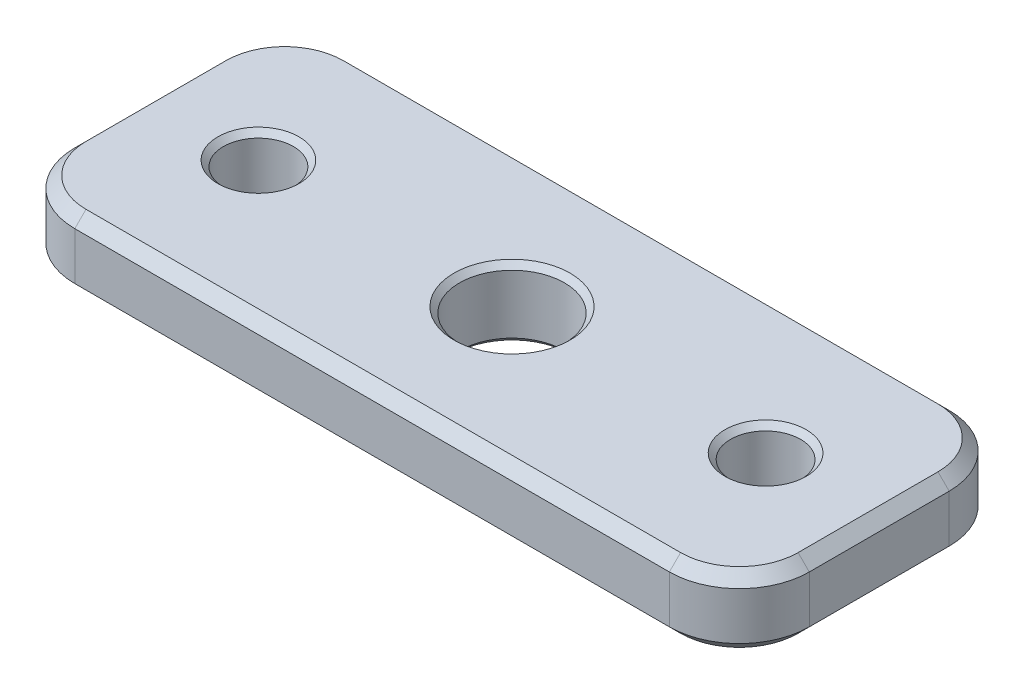
ISO-10303-21;
HEADER;
FILE_DESCRIPTION(('STEP AP214'),'2;1');
FILE_NAME('part.step','',(''),(''),'','','');
FILE_SCHEMA(('AUTOMOTIVE_DESIGN { 1 0 10303 214 1 1 1 1 }'));
ENDSEC;
DATA;
#1=APPLICATION_CONTEXT('core data for automotive mechanical design processes');
#2=APPLICATION_PROTOCOL_DEFINITION('international standard','automotive_design',2000,#1);
#3=PRODUCT_CONTEXT('',#1,'mechanical');
#4=PRODUCT('Part','Part','',(#3));
#5=PRODUCT_RELATED_PRODUCT_CATEGORY('part','',(#4));
#6=PRODUCT_DEFINITION_FORMATION('','',#4);
#7=PRODUCT_DEFINITION_CONTEXT('part definition',#1,'design');
#8=PRODUCT_DEFINITION('design','',#6,#7);
#9=PRODUCT_DEFINITION_SHAPE('','',#8);
#10=(LENGTH_UNIT() NAMED_UNIT(*) SI_UNIT(.MILLI.,.METRE.));
#11=(NAMED_UNIT(*) PLANE_ANGLE_UNIT() SI_UNIT($,.RADIAN.));
#12=(NAMED_UNIT(*) SI_UNIT($,.STERADIAN.) SOLID_ANGLE_UNIT());
#13=UNCERTAINTY_MEASURE_WITH_UNIT(LENGTH_MEASURE(1.E-05),#10,'distance_accuracy_value','');
#14=(GEOMETRIC_REPRESENTATION_CONTEXT(3) GLOBAL_UNCERTAINTY_ASSIGNED_CONTEXT((#13)) GLOBAL_UNIT_ASSIGNED_CONTEXT((#10,
#11,#12)) REPRESENTATION_CONTEXT('',''));
#15=CARTESIAN_POINT('',(0.,0.,0.));
#16=DIRECTION('',(0.,0.,1.));
#17=DIRECTION('',(1.,0.,0.));
#18=AXIS2_PLACEMENT_3D('',#15,#16,#17);
#19=CARTESIAN_POINT('',(0.,3.175,0.));
#20=DIRECTION('',(0.,-1.,0.));
#21=DIRECTION('',(0.,0.,-1.));
#22=AXIS2_PLACEMENT_3D('',#19,#20,#21);
#23=PLANE('',#22);
#24=CARTESIAN_POINT('',(11.509375,3.175,0.));
#25=DIRECTION('',(0.,-1.,0.));
#26=DIRECTION('',(0.,0.,-1.));
#27=AXIS2_PLACEMENT_3D('',#24,#25,#26);
#28=CIRCLE('',#27,1.8415);
#29=CARTESIAN_POINT('',(11.509375,3.175,-1.8415));
#30=VERTEX_POINT('',#29);
#31=EDGE_CURVE('E225',#30,#30,#28,.T.);
#32=ORIENTED_EDGE('',*,*,#31,.T.);
#33=EDGE_LOOP('',(#32));
#34=FACE_BOUND('',#33,.T.);
#35=CARTESIAN_POINT('',(0.,3.175,0.));
#36=DIRECTION('',(0.,-1.,0.));
#37=DIRECTION('',(0.,0.,-1.));
#38=AXIS2_PLACEMENT_3D('',#35,#36,#37);
#39=CIRCLE('',#38,2.63525000000002);
#40=CARTESIAN_POINT('',(0.,3.175,-2.63525000000002));
#41=VERTEX_POINT('',#40);
#42=EDGE_CURVE('E222',#41,#41,#39,.T.);
#43=ORIENTED_EDGE('',*,*,#42,.T.);
#44=EDGE_LOOP('',(#43));
#45=FACE_BOUND('',#44,.T.);
#46=CARTESIAN_POINT('',(-11.509375,3.175,0.));
#47=DIRECTION('',(0.,-1.,0.));
#48=DIRECTION('',(0.,0.,-1.));
#49=AXIS2_PLACEMENT_3D('',#46,#47,#48);
#50=CIRCLE('',#49,1.8415);
#51=CARTESIAN_POINT('',(-11.509375,3.175,-1.8415));
#52=VERTEX_POINT('',#51);
#53=EDGE_CURVE('E219',#52,#52,#50,.T.);
#54=ORIENTED_EDGE('',*,*,#53,.T.);
#55=EDGE_LOOP('',(#54));
#56=FACE_BOUND('',#55,.T.);
#57=CARTESIAN_POINT('',(13.49375,3.175,-3.175));
#58=DIRECTION('',(0.,-1.,0.));
#59=DIRECTION('',(0.,0.,-1.));
#60=AXIS2_PLACEMENT_3D('',#57,#58,#59);
#61=CIRCLE('',#60,2.66699999999999);
#62=CARTESIAN_POINT('',(16.16075,3.175,-3.175));
#63=VERTEX_POINT('',#62);
#64=CARTESIAN_POINT('',(13.49375,3.175,-5.842));
#65=VERTEX_POINT('',#64);
#66=EDGE_CURVE('E695',#63,#65,#61,.F.);
#67=ORIENTED_EDGE('',*,*,#66,.T.);
#68=DIRECTION('',(-1.,0.,0.));
#69=VECTOR('',#68,1.);
#70=CARTESIAN_POINT('',(0.,3.175,-5.842));
#71=LINE('',#70,#69);
#72=CARTESIAN_POINT('',(-13.49375,3.175,-5.842));
#73=VERTEX_POINT('',#72);
#74=EDGE_CURVE('E699',#65,#73,#71,.T.);
#75=ORIENTED_EDGE('',*,*,#74,.T.);
#76=CARTESIAN_POINT('',(-13.49375,3.175,-3.175));
#77=DIRECTION('',(0.,-1.,0.));
#78=DIRECTION('',(0.,0.,-1.));
#79=AXIS2_PLACEMENT_3D('',#76,#77,#78);
#80=CIRCLE('',#79,2.667);
#81=CARTESIAN_POINT('',(-16.16075,3.175,-3.175));
#82=VERTEX_POINT('',#81);
#83=EDGE_CURVE('E697',#73,#82,#80,.F.);
#84=ORIENTED_EDGE('',*,*,#83,.T.);
#85=DIRECTION('',(0.,0.,1.));
#86=VECTOR('',#85,1.);
#87=CARTESIAN_POINT('',(-16.16075,3.175,0.));
#88=LINE('',#87,#86);
#89=CARTESIAN_POINT('',(-16.16075,3.175,3.175));
#90=VERTEX_POINT('',#89);
#91=EDGE_CURVE('E151',#82,#90,#88,.T.);
#92=ORIENTED_EDGE('',*,*,#91,.T.);
#93=CARTESIAN_POINT('',(-13.49375,3.175,3.175));
#94=DIRECTION('',(0.,-1.,0.));
#95=DIRECTION('',(0.,0.,-1.));
#96=AXIS2_PLACEMENT_3D('',#93,#94,#95);
#97=CIRCLE('',#96,2.66699999999999);
#98=CARTESIAN_POINT('',(-13.49375,3.175,5.842));
#99=VERTEX_POINT('',#98);
#100=EDGE_CURVE('E146',#90,#99,#97,.F.);
#101=ORIENTED_EDGE('',*,*,#100,.T.);
#102=DIRECTION('',(1.,0.,0.));
#103=VECTOR('',#102,1.);
#104=CARTESIAN_POINT('',(0.,3.175,5.842));
#105=LINE('',#104,#103);
#106=CARTESIAN_POINT('',(13.49375,3.175,5.842));
#107=VERTEX_POINT('',#106);
#108=EDGE_CURVE('E148',#99,#107,#105,.T.);
#109=ORIENTED_EDGE('',*,*,#108,.T.);
#110=CARTESIAN_POINT('',(13.49375,3.175,3.175));
#111=DIRECTION('',(0.,-1.,0.));
#112=DIRECTION('',(0.,0.,-1.));
#113=AXIS2_PLACEMENT_3D('',#110,#111,#112);
#114=CIRCLE('',#113,2.667);
#115=CARTESIAN_POINT('',(16.16075,3.175,3.175));
#116=VERTEX_POINT('',#115);
#117=EDGE_CURVE('E157',#107,#116,#114,.F.);
#118=ORIENTED_EDGE('',*,*,#117,.T.);
#119=DIRECTION('',(0.,0.,-1.));
#120=VECTOR('',#119,1.);
#121=CARTESIAN_POINT('',(16.16075,3.175,0.));
#122=LINE('',#121,#120);
#123=EDGE_CURVE('E156',#116,#63,#122,.T.);
#124=ORIENTED_EDGE('',*,*,#123,.T.);
#125=EDGE_LOOP('',(#67,#75,#84,#92,#101,#109,#118,#124));
#126=FACE_BOUND('',#125,.T.);
#127=ADVANCED_FACE('F32',(#34,#45,#56,#126),#23,.F.);
#128=CARTESIAN_POINT('',(0.,0.,0.));
#129=DIRECTION('',(0.,-1.,0.));
#130=DIRECTION('',(0.,0.,-1.));
#131=AXIS2_PLACEMENT_3D('',#128,#129,#130);
#132=PLANE('',#131);
#133=CARTESIAN_POINT('',(11.509375,0.,0.));
#134=DIRECTION('',(0.,-1.,0.));
#135=DIRECTION('',(0.,0.,-1.));
#136=AXIS2_PLACEMENT_3D('',#133,#134,#135);
#137=CIRCLE('',#136,1.84150000000001);
#138=CARTESIAN_POINT('',(11.509375,0.,-1.84150000000001));
#139=VERTEX_POINT('',#138);
#140=EDGE_CURVE('E210',#139,#139,#137,.F.);
#141=ORIENTED_EDGE('',*,*,#140,.T.);
#142=EDGE_LOOP('',(#141));
#143=FACE_BOUND('',#142,.T.);
#144=CARTESIAN_POINT('',(0.,0.,0.));
#145=DIRECTION('',(0.,-1.,0.));
#146=DIRECTION('',(0.,0.,-1.));
#147=AXIS2_PLACEMENT_3D('',#144,#145,#146);
#148=CIRCLE('',#147,2.63525000000001);
#149=CARTESIAN_POINT('',(0.,0.,-2.63525000000001));
#150=VERTEX_POINT('',#149);
#151=EDGE_CURVE('E206',#150,#150,#148,.F.);
#152=ORIENTED_EDGE('',*,*,#151,.T.);
#153=EDGE_LOOP('',(#152));
#154=FACE_BOUND('',#153,.T.);
#155=CARTESIAN_POINT('',(-11.509375,0.,0.));
#156=DIRECTION('',(0.,-1.,0.));
#157=DIRECTION('',(0.,0.,-1.));
#158=AXIS2_PLACEMENT_3D('',#155,#156,#157);
#159=CIRCLE('',#158,1.8415);
#160=CARTESIAN_POINT('',(-11.509375,0.,-1.8415));
#161=VERTEX_POINT('',#160);
#162=EDGE_CURVE('E203',#161,#161,#159,.F.);
#163=ORIENTED_EDGE('',*,*,#162,.T.);
#164=EDGE_LOOP('',(#163));
#165=FACE_BOUND('',#164,.T.);
#166=CARTESIAN_POINT('',(-13.49375,0.,-3.175));
#167=DIRECTION('',(0.,-1.,0.));
#168=DIRECTION('',(0.,0.,-1.));
#169=AXIS2_PLACEMENT_3D('',#166,#167,#168);
#170=CIRCLE('',#169,2.66700000000001);
#171=CARTESIAN_POINT('',(-16.16075,0.,-3.175));
#172=VERTEX_POINT('',#171);
#173=CARTESIAN_POINT('',(-13.49375,0.,-5.842));
#174=VERTEX_POINT('',#173);
#175=EDGE_CURVE('E47',#172,#174,#170,.T.);
#176=ORIENTED_EDGE('',*,*,#175,.T.);
#177=DIRECTION('',(1.,0.,0.));
#178=VECTOR('',#177,1.);
#179=CARTESIAN_POINT('',(13.49375,0.,-5.842));
#180=LINE('',#179,#178);
#181=CARTESIAN_POINT('',(13.49375,0.,-5.84200000000001));
#182=VERTEX_POINT('',#181);
#183=EDGE_CURVE('E207',#174,#182,#180,.T.);
#184=ORIENTED_EDGE('',*,*,#183,.T.);
#185=CARTESIAN_POINT('',(13.49375,0.,-3.175));
#186=DIRECTION('',(0.,-1.,0.));
#187=DIRECTION('',(0.,0.,-1.));
#188=AXIS2_PLACEMENT_3D('',#185,#186,#187);
#189=CIRCLE('',#188,2.66700000000001);
#190=CARTESIAN_POINT('',(16.16075,0.,-3.175));
#191=VERTEX_POINT('',#190);
#192=EDGE_CURVE('E620',#182,#191,#189,.T.);
#193=ORIENTED_EDGE('',*,*,#192,.T.);
#194=DIRECTION('',(0.,0.,1.));
#195=VECTOR('',#194,1.);
#196=CARTESIAN_POINT('',(16.16075,0.,3.175));
#197=LINE('',#196,#195);
#198=CARTESIAN_POINT('',(16.16075,0.,3.175));
#199=VERTEX_POINT('',#198);
#200=EDGE_CURVE('E611',#191,#199,#197,.T.);
#201=ORIENTED_EDGE('',*,*,#200,.T.);
#202=CARTESIAN_POINT('',(13.49375,0.,3.175));
#203=DIRECTION('',(0.,-1.,0.));
#204=DIRECTION('',(0.,0.,-1.));
#205=AXIS2_PLACEMENT_3D('',#202,#203,#204);
#206=CIRCLE('',#205,2.66700000000001);
#207=CARTESIAN_POINT('',(13.49375,0.,5.842));
#208=VERTEX_POINT('',#207);
#209=EDGE_CURVE('E612',#199,#208,#206,.T.);
#210=ORIENTED_EDGE('',*,*,#209,.T.);
#211=DIRECTION('',(-1.,0.,0.));
#212=VECTOR('',#211,1.);
#213=CARTESIAN_POINT('',(-13.49375,0.,5.842));
#214=LINE('',#213,#212);
#215=CARTESIAN_POINT('',(-13.49375,0.,5.842));
#216=VERTEX_POINT('',#215);
#217=EDGE_CURVE('E605',#208,#216,#214,.T.);
#218=ORIENTED_EDGE('',*,*,#217,.T.);
#219=CARTESIAN_POINT('',(-13.49375,0.,3.175));
#220=DIRECTION('',(0.,-1.,0.));
#221=DIRECTION('',(0.,0.,-1.));
#222=AXIS2_PLACEMENT_3D('',#219,#220,#221);
#223=CIRCLE('',#222,2.66700000000001);
#224=CARTESIAN_POINT('',(-16.16075,0.,3.175));
#225=VERTEX_POINT('',#224);
#226=EDGE_CURVE('E609',#216,#225,#223,.T.);
#227=ORIENTED_EDGE('',*,*,#226,.T.);
#228=DIRECTION('',(0.,0.,-1.));
#229=VECTOR('',#228,1.);
#230=CARTESIAN_POINT('',(-16.16075,0.,-3.175));
#231=LINE('',#230,#229);
#232=EDGE_CURVE('E614',#225,#172,#231,.T.);
#233=ORIENTED_EDGE('',*,*,#232,.T.);
#234=EDGE_LOOP('',(#176,#184,#193,#201,#210,#218,#227,#233));
#235=FACE_BOUND('',#234,.T.);
#236=ADVANCED_FACE('F248',(#143,#154,#165,#235),#132,.T.);
#237=CARTESIAN_POINT('',(16.66875,3.175,6.35));
#238=DIRECTION('',(-1.,0.,0.));
#239=DIRECTION('',(0.,0.,1.));
#240=AXIS2_PLACEMENT_3D('',#237,#238,#239);
#241=PLANE('',#240);
#242=DIRECTION('',(0.,-1.,0.));
#243=VECTOR('',#242,1.);
#244=CARTESIAN_POINT('',(16.66875,3.175,-3.175));
#245=LINE('',#244,#243);
#246=CARTESIAN_POINT('',(16.66875,0.507999999999995,-3.175));
#247=VERTEX_POINT('',#246);
#248=CARTESIAN_POINT('',(16.66875,2.66699999999999,-3.175));
#249=VERTEX_POINT('',#248);
#250=EDGE_CURVE('E174',#247,#249,#245,.F.);
#251=ORIENTED_EDGE('',*,*,#250,.T.);
#252=DIRECTION('',(0.,0.,1.));
#253=VECTOR('',#252,1.);
#254=CARTESIAN_POINT('',(16.66875,2.66699999999999,6.35));
#255=LINE('',#254,#253);
#256=CARTESIAN_POINT('',(16.66875,2.66699999999999,3.175));
#257=VERTEX_POINT('',#256);
#258=EDGE_CURVE('E642',#249,#257,#255,.T.);
#259=ORIENTED_EDGE('',*,*,#258,.T.);
#260=DIRECTION('',(0.,-1.,0.));
#261=VECTOR('',#260,1.);
#262=CARTESIAN_POINT('',(16.66875,3.175,3.175));
#263=LINE('',#262,#261);
#264=CARTESIAN_POINT('',(16.66875,0.507999999999995,3.175));
#265=VERTEX_POINT('',#264);
#266=EDGE_CURVE('E670',#257,#265,#263,.T.);
#267=ORIENTED_EDGE('',*,*,#266,.T.);
#268=DIRECTION('',(0.,0.,-1.));
#269=VECTOR('',#268,1.);
#270=CARTESIAN_POINT('',(16.66875,0.507999999999995,-3.175));
#271=LINE('',#270,#269);
#272=EDGE_CURVE('E639',#265,#247,#271,.T.);
#273=ORIENTED_EDGE('',*,*,#272,.T.);
#274=EDGE_LOOP('',(#251,#259,#267,#273));
#275=FACE_BOUND('',#274,.T.);
#276=ADVANCED_FACE('F254',(#275),#241,.F.);
#277=CARTESIAN_POINT('',(-16.66875,3.175,-6.35));
#278=DIRECTION('',(0.,0.,1.));
#279=DIRECTION('',(1.,0.,0.));
#280=AXIS2_PLACEMENT_3D('',#277,#278,#279);
#281=PLANE('',#280);
#282=DIRECTION('',(0.,-1.,0.));
#283=VECTOR('',#282,1.);
#284=CARTESIAN_POINT('',(-13.49375,3.175,-6.35));
#285=LINE('',#284,#283);
#286=CARTESIAN_POINT('',(-13.49375,0.507999999999995,-6.35));
#287=VERTEX_POINT('',#286);
#288=CARTESIAN_POINT('',(-13.49375,2.66699999999999,-6.35));
#289=VERTEX_POINT('',#288);
#290=EDGE_CURVE('E168',#287,#289,#285,.F.);
#291=ORIENTED_EDGE('',*,*,#290,.T.);
#292=DIRECTION('',(1.,0.,0.));
#293=VECTOR('',#292,1.);
#294=CARTESIAN_POINT('',(-16.66875,2.66699999999999,-6.35));
#295=LINE('',#294,#293);
#296=CARTESIAN_POINT('',(13.49375,2.66699999999999,-6.35));
#297=VERTEX_POINT('',#296);
#298=EDGE_CURVE('E705',#289,#297,#295,.T.);
#299=ORIENTED_EDGE('',*,*,#298,.T.);
#300=DIRECTION('',(0.,-1.,0.));
#301=VECTOR('',#300,1.);
#302=CARTESIAN_POINT('',(13.49375,3.175,-6.35));
#303=LINE('',#302,#301);
#304=CARTESIAN_POINT('',(13.49375,0.507999999999995,-6.35));
#305=VERTEX_POINT('',#304);
#306=EDGE_CURVE('E688',#297,#305,#303,.T.);
#307=ORIENTED_EDGE('',*,*,#306,.T.);
#308=DIRECTION('',(-1.,0.,0.));
#309=VECTOR('',#308,1.);
#310=CARTESIAN_POINT('',(-13.49375,0.507999999999995,-6.35));
#311=LINE('',#310,#309);
#312=EDGE_CURVE('E702',#305,#287,#311,.T.);
#313=ORIENTED_EDGE('',*,*,#312,.T.);
#314=EDGE_LOOP('',(#291,#299,#307,#313));
#315=FACE_BOUND('',#314,.T.);
#316=ADVANCED_FACE('F268',(#315),#281,.F.);
#317=CARTESIAN_POINT('',(-16.66875,3.175,6.35));
#318=DIRECTION('',(1.,0.,0.));
#319=DIRECTION('',(0.,0.,-1.));
#320=AXIS2_PLACEMENT_3D('',#317,#318,#319);
#321=PLANE('',#320);
#322=DIRECTION('',(0.,-1.,0.));
#323=VECTOR('',#322,1.);
#324=CARTESIAN_POINT('',(-16.66875,3.175,3.175));
#325=LINE('',#324,#323);
#326=CARTESIAN_POINT('',(-16.66875,0.507999999999995,3.175));
#327=VERTEX_POINT('',#326);
#328=CARTESIAN_POINT('',(-16.66875,2.66699999999999,3.175));
#329=VERTEX_POINT('',#328);
#330=EDGE_CURVE('E684',#327,#329,#325,.F.);
#331=ORIENTED_EDGE('',*,*,#330,.T.);
#332=DIRECTION('',(0.,0.,-1.));
#333=VECTOR('',#332,1.);
#334=CARTESIAN_POINT('',(-16.66875,2.66699999999999,6.35));
#335=LINE('',#334,#333);
#336=CARTESIAN_POINT('',(-16.66875,2.66699999999999,-3.175));
#337=VERTEX_POINT('',#336);
#338=EDGE_CURVE('E634',#329,#337,#335,.T.);
#339=ORIENTED_EDGE('',*,*,#338,.T.);
#340=DIRECTION('',(0.,-1.,0.));
#341=VECTOR('',#340,1.);
#342=CARTESIAN_POINT('',(-16.66875,3.175,-3.175));
#343=LINE('',#342,#341);
#344=CARTESIAN_POINT('',(-16.66875,0.507999999999995,-3.175));
#345=VERTEX_POINT('',#344);
#346=EDGE_CURVE('E686',#337,#345,#343,.T.);
#347=ORIENTED_EDGE('',*,*,#346,.T.);
#348=DIRECTION('',(0.,0.,1.));
#349=VECTOR('',#348,1.);
#350=CARTESIAN_POINT('',(-16.66875,0.507999999999995,3.175));
#351=LINE('',#350,#349);
#352=EDGE_CURVE('E640',#345,#327,#351,.T.);
#353=ORIENTED_EDGE('',*,*,#352,.T.);
#354=EDGE_LOOP('',(#331,#339,#347,#353));
#355=FACE_BOUND('',#354,.T.);
#356=ADVANCED_FACE('F264',(#355),#321,.F.);
#357=CARTESIAN_POINT('',(-16.66875,3.175,6.35));
#358=DIRECTION('',(0.,0.,-1.));
#359=DIRECTION('',(-1.,0.,0.));
#360=AXIS2_PLACEMENT_3D('',#357,#358,#359);
#361=PLANE('',#360);
#362=DIRECTION('',(0.,-1.,0.));
#363=VECTOR('',#362,1.);
#364=CARTESIAN_POINT('',(13.49375,3.175,6.35));
#365=LINE('',#364,#363);
#366=CARTESIAN_POINT('',(13.49375,0.507999999999995,6.35));
#367=VERTEX_POINT('',#366);
#368=CARTESIAN_POINT('',(13.49375,2.66699999999999,6.35));
#369=VERTEX_POINT('',#368);
#370=EDGE_CURVE('E681',#367,#369,#365,.F.);
#371=ORIENTED_EDGE('',*,*,#370,.T.);
#372=DIRECTION('',(-1.,0.,0.));
#373=VECTOR('',#372,1.);
#374=CARTESIAN_POINT('',(-16.66875,2.66699999999999,6.35));
#375=LINE('',#374,#373);
#376=CARTESIAN_POINT('',(-13.49375,2.66699999999999,6.35));
#377=VERTEX_POINT('',#376);
#378=EDGE_CURVE('E657',#369,#377,#375,.T.);
#379=ORIENTED_EDGE('',*,*,#378,.T.);
#380=DIRECTION('',(0.,-1.,0.));
#381=VECTOR('',#380,1.);
#382=CARTESIAN_POINT('',(-13.49375,3.175,6.35));
#383=LINE('',#382,#381);
#384=CARTESIAN_POINT('',(-13.49375,0.507999999999995,6.35));
#385=VERTEX_POINT('',#384);
#386=EDGE_CURVE('E676',#377,#385,#383,.T.);
#387=ORIENTED_EDGE('',*,*,#386,.T.);
#388=DIRECTION('',(1.,0.,0.));
#389=VECTOR('',#388,1.);
#390=CARTESIAN_POINT('',(13.49375,0.507999999999995,6.35));
#391=LINE('',#390,#389);
#392=EDGE_CURVE('E606',#385,#367,#391,.T.);
#393=ORIENTED_EDGE('',*,*,#392,.T.);
#394=EDGE_LOOP('',(#371,#379,#387,#393));
#395=FACE_BOUND('',#394,.T.);
#396=ADVANCED_FACE('F261',(#395),#361,.F.);
#397=CARTESIAN_POINT('',(-11.509375,3.175,0.));
#398=DIRECTION('',(0.,-1.,0.));
#399=DIRECTION('',(0.,0.,-1.));
#400=AXIS2_PLACEMENT_3D('',#397,#398,#399);
#401=CYLINDRICAL_SURFACE('',#400,1.5875);
#402=CARTESIAN_POINT('',(-11.509375,0.254,0.));
#403=DIRECTION('',(0.,-1.,0.));
#404=DIRECTION('',(0.,0.,-1.));
#405=AXIS2_PLACEMENT_3D('',#402,#403,#404);
#406=CIRCLE('',#405,1.5875);
#407=CARTESIAN_POINT('',(-11.509375,0.254,-1.5875));
#408=VERTEX_POINT('',#407);
#409=EDGE_CURVE('E11',#408,#408,#406,.T.);
#410=ORIENTED_EDGE('',*,*,#409,.T.);
#411=EDGE_LOOP('',(#410));
#412=FACE_BOUND('',#411,.T.);
#413=CARTESIAN_POINT('',(-11.509375,2.921,0.));
#414=DIRECTION('',(0.,-1.,0.));
#415=DIRECTION('',(0.,0.,-1.));
#416=AXIS2_PLACEMENT_3D('',#413,#414,#415);
#417=CIRCLE('',#416,1.5875);
#418=CARTESIAN_POINT('',(-11.509375,2.921,-1.5875));
#419=VERTEX_POINT('',#418);
#420=EDGE_CURVE('E40',#419,#419,#417,.F.);
#421=ORIENTED_EDGE('',*,*,#420,.T.);
#422=EDGE_LOOP('',(#421));
#423=FACE_BOUND('',#422,.T.);
#424=ADVANCED_FACE('F236',(#412,#423),#401,.F.);
#425=CARTESIAN_POINT('',(11.509375,3.175,0.));
#426=DIRECTION('',(0.,-1.,0.));
#427=DIRECTION('',(0.,0.,-1.));
#428=AXIS2_PLACEMENT_3D('',#425,#426,#427);
#429=CYLINDRICAL_SURFACE('',#428,1.5875);
#430=CARTESIAN_POINT('',(11.509375,0.254000000000011,0.));
#431=DIRECTION('',(0.,-1.,0.));
#432=DIRECTION('',(0.,0.,-1.));
#433=AXIS2_PLACEMENT_3D('',#430,#431,#432);
#434=CIRCLE('',#433,1.5875);
#435=CARTESIAN_POINT('',(11.509375,0.254000000000011,-1.5875));
#436=VERTEX_POINT('',#435);
#437=EDGE_CURVE('E216',#436,#436,#434,.T.);
#438=ORIENTED_EDGE('',*,*,#437,.T.);
#439=EDGE_LOOP('',(#438));
#440=FACE_BOUND('',#439,.T.);
#441=CARTESIAN_POINT('',(11.509375,2.921,0.));
#442=DIRECTION('',(0.,-1.,0.));
#443=DIRECTION('',(0.,0.,-1.));
#444=AXIS2_PLACEMENT_3D('',#441,#442,#443);
#445=CIRCLE('',#444,1.5875);
#446=CARTESIAN_POINT('',(11.509375,2.921,-1.5875));
#447=VERTEX_POINT('',#446);
#448=EDGE_CURVE('E213',#447,#447,#445,.F.);
#449=ORIENTED_EDGE('',*,*,#448,.T.);
#450=EDGE_LOOP('',(#449));
#451=FACE_BOUND('',#450,.T.);
#452=ADVANCED_FACE('F373',(#440,#451),#429,.F.);
#453=CARTESIAN_POINT('',(0.,3.175,0.));
#454=DIRECTION('',(0.,-1.,0.));
#455=DIRECTION('',(0.,0.,-1.));
#456=AXIS2_PLACEMENT_3D('',#453,#454,#455);
#457=CYLINDRICAL_SURFACE('',#456,2.38125);
#458=CARTESIAN_POINT('',(0.,0.254000000000011,0.));
#459=DIRECTION('',(0.,-1.,0.));
#460=DIRECTION('',(0.,0.,-1.));
#461=AXIS2_PLACEMENT_3D('',#458,#459,#460);
#462=CIRCLE('',#461,2.38125);
#463=CARTESIAN_POINT('',(0.,0.254000000000011,-2.38125));
#464=VERTEX_POINT('',#463);
#465=EDGE_CURVE('E231',#464,#464,#462,.T.);
#466=ORIENTED_EDGE('',*,*,#465,.T.);
#467=EDGE_LOOP('',(#466));
#468=FACE_BOUND('',#467,.T.);
#469=CARTESIAN_POINT('',(0.,2.92099999999999,0.));
#470=DIRECTION('',(0.,-1.,0.));
#471=DIRECTION('',(0.,0.,-1.));
#472=AXIS2_PLACEMENT_3D('',#469,#470,#471);
#473=CIRCLE('',#472,2.38125);
#474=CARTESIAN_POINT('',(0.,2.92099999999999,-2.38125));
#475=VERTEX_POINT('',#474);
#476=EDGE_CURVE('E228',#475,#475,#473,.F.);
#477=ORIENTED_EDGE('',*,*,#476,.T.);
#478=EDGE_LOOP('',(#477));
#479=FACE_BOUND('',#478,.T.);
#480=ADVANCED_FACE('F280',(#468,#479),#457,.F.);
#481=CARTESIAN_POINT('',(13.49375,3.175,3.175));
#482=DIRECTION('',(0.,-1.,0.));
#483=DIRECTION('',(0.,0.,-1.));
#484=AXIS2_PLACEMENT_3D('',#481,#482,#483);
#485=CYLINDRICAL_SURFACE('',#484,3.175);
#486=ORIENTED_EDGE('',*,*,#266,.F.);
#487=CARTESIAN_POINT('',(13.49375,2.66699999999999,3.175));
#488=DIRECTION('',(0.,-1.,0.));
#489=DIRECTION('',(0.,0.,-1.));
#490=AXIS2_PLACEMENT_3D('',#487,#488,#489);
#491=CIRCLE('',#490,3.175);
#492=EDGE_CURVE('E654',#257,#369,#491,.T.);
#493=ORIENTED_EDGE('',*,*,#492,.T.);
#494=ORIENTED_EDGE('',*,*,#370,.F.);
#495=CARTESIAN_POINT('',(13.49375,0.507999999999995,3.175));
#496=DIRECTION('',(0.,-1.,0.));
#497=DIRECTION('',(0.,0.,-1.));
#498=AXIS2_PLACEMENT_3D('',#495,#496,#497);
#499=CIRCLE('',#498,3.175);
#500=EDGE_CURVE('E652',#367,#265,#499,.F.);
#501=ORIENTED_EDGE('',*,*,#500,.T.);
#502=EDGE_LOOP('',(#486,#493,#494,#501));
#503=FACE_BOUND('',#502,.T.);
#504=ADVANCED_FACE('F276',(#503),#485,.T.);
#505=CARTESIAN_POINT('',(-13.49375,3.175,-3.175));
#506=DIRECTION('',(0.,-1.,0.));
#507=DIRECTION('',(0.,0.,-1.));
#508=AXIS2_PLACEMENT_3D('',#505,#506,#507);
#509=CYLINDRICAL_SURFACE('',#508,3.175);
#510=ORIENTED_EDGE('',*,*,#346,.F.);
#511=CARTESIAN_POINT('',(-13.49375,2.66699999999999,-3.175));
#512=DIRECTION('',(0.,-1.,0.));
#513=DIRECTION('',(0.,0.,-1.));
#514=AXIS2_PLACEMENT_3D('',#511,#512,#513);
#515=CIRCLE('',#514,3.175);
#516=EDGE_CURVE('E710',#337,#289,#515,.T.);
#517=ORIENTED_EDGE('',*,*,#516,.T.);
#518=ORIENTED_EDGE('',*,*,#290,.F.);
#519=CARTESIAN_POINT('',(-13.49375,0.507999999999995,-3.175));
#520=DIRECTION('',(0.,-1.,0.));
#521=DIRECTION('',(0.,0.,-1.));
#522=AXIS2_PLACEMENT_3D('',#519,#520,#521);
#523=CIRCLE('',#522,3.175);
#524=EDGE_CURVE('E708',#287,#345,#523,.F.);
#525=ORIENTED_EDGE('',*,*,#524,.T.);
#526=EDGE_LOOP('',(#510,#517,#518,#525));
#527=FACE_BOUND('',#526,.T.);
#528=ADVANCED_FACE('F279',(#527),#509,.T.);
#529=CARTESIAN_POINT('',(13.49375,3.175,-3.175));
#530=DIRECTION('',(0.,-1.,0.));
#531=DIRECTION('',(0.,0.,-1.));
#532=AXIS2_PLACEMENT_3D('',#529,#530,#531);
#533=CYLINDRICAL_SURFACE('',#532,3.175);
#534=ORIENTED_EDGE('',*,*,#306,.F.);
#535=CARTESIAN_POINT('',(13.49375,2.66699999999999,-3.175));
#536=DIRECTION('',(0.,-1.,0.));
#537=DIRECTION('',(0.,0.,-1.));
#538=AXIS2_PLACEMENT_3D('',#535,#536,#537);
#539=CIRCLE('',#538,3.175);
#540=EDGE_CURVE('E644',#297,#249,#539,.T.);
#541=ORIENTED_EDGE('',*,*,#540,.T.);
#542=ORIENTED_EDGE('',*,*,#250,.F.);
#543=CARTESIAN_POINT('',(13.49375,0.507999999999995,-3.175));
#544=DIRECTION('',(0.,-1.,0.));
#545=DIRECTION('',(0.,0.,-1.));
#546=AXIS2_PLACEMENT_3D('',#543,#544,#545);
#547=CIRCLE('',#546,3.175);
#548=EDGE_CURVE('E672',#247,#305,#547,.F.);
#549=ORIENTED_EDGE('',*,*,#548,.T.);
#550=EDGE_LOOP('',(#534,#541,#542,#549));
#551=FACE_BOUND('',#550,.T.);
#552=ADVANCED_FACE('F284',(#551),#533,.T.);
#553=CARTESIAN_POINT('',(-13.49375,3.175,3.175));
#554=DIRECTION('',(0.,-1.,0.));
#555=DIRECTION('',(0.,0.,-1.));
#556=AXIS2_PLACEMENT_3D('',#553,#554,#555);
#557=CYLINDRICAL_SURFACE('',#556,3.175);
#558=ORIENTED_EDGE('',*,*,#386,.F.);
#559=CARTESIAN_POINT('',(-13.49375,2.66699999999999,3.175));
#560=DIRECTION('',(0.,-1.,0.));
#561=DIRECTION('',(0.,0.,-1.));
#562=AXIS2_PLACEMENT_3D('',#559,#560,#561);
#563=CIRCLE('',#562,3.175);
#564=EDGE_CURVE('E171',#377,#329,#563,.T.);
#565=ORIENTED_EDGE('',*,*,#564,.T.);
#566=ORIENTED_EDGE('',*,*,#330,.F.);
#567=CARTESIAN_POINT('',(-13.49375,0.507999999999995,3.175));
#568=DIRECTION('',(0.,-1.,0.));
#569=DIRECTION('',(0.,0.,-1.));
#570=AXIS2_PLACEMENT_3D('',#567,#568,#569);
#571=CIRCLE('',#570,3.175);
#572=EDGE_CURVE('E649',#327,#385,#571,.F.);
#573=ORIENTED_EDGE('',*,*,#572,.T.);
#574=EDGE_LOOP('',(#558,#565,#566,#573));
#575=FACE_BOUND('',#574,.T.);
#576=ADVANCED_FACE('F288',(#575),#557,.T.);
#577=CARTESIAN_POINT('',(0.,3.175,5.842));
#578=DIRECTION('',(0.,-0.707106781186545,-0.70710678118655));
#579=DIRECTION('',(1.,0.,0.));
#580=AXIS2_PLACEMENT_3D('',#577,#578,#579);
#581=PLANE('',#580);
#582=DIRECTION('',(0.,0.70710678118655,-0.707106781186545));
#583=VECTOR('',#582,1.);
#584=CARTESIAN_POINT('',(-13.49375,2.66699999999999,6.35));
#585=LINE('',#584,#583);
#586=EDGE_CURVE('E163',#377,#99,#585,.T.);
#587=ORIENTED_EDGE('',*,*,#586,.F.);
#588=ORIENTED_EDGE('',*,*,#378,.F.);
#589=DIRECTION('',(0.,-0.70710678118655,0.707106781186545));
#590=VECTOR('',#589,1.);
#591=CARTESIAN_POINT('',(13.49375,3.175,5.842));
#592=LINE('',#591,#590);
#593=EDGE_CURVE('E166',#107,#369,#592,.T.);
#594=ORIENTED_EDGE('',*,*,#593,.F.);
#595=ORIENTED_EDGE('',*,*,#108,.F.);
#596=EDGE_LOOP('',(#587,#588,#594,#595));
#597=FACE_BOUND('',#596,.T.);
#598=ADVANCED_FACE('F161',(#597),#581,.F.);
#599=CARTESIAN_POINT('',(13.49375,3.175,3.175));
#600=DIRECTION('',(0.,-1.,0.));
#601=DIRECTION('',(0.,0.,-1.));
#602=AXIS2_PLACEMENT_3D('',#599,#600,#601);
#603=CONICAL_SURFACE('',#602,2.667,0.785398163397444);
#604=ORIENTED_EDGE('',*,*,#593,.T.);
#605=ORIENTED_EDGE('',*,*,#492,.F.);
#606=DIRECTION('',(0.707106781186545,-0.70710678118655,0.));
#607=VECTOR('',#606,1.);
#608=CARTESIAN_POINT('',(16.16075,3.175,3.175));
#609=LINE('',#608,#607);
#610=EDGE_CURVE('E172',#116,#257,#609,.T.);
#611=ORIENTED_EDGE('',*,*,#610,.F.);
#612=ORIENTED_EDGE('',*,*,#117,.F.);
#613=EDGE_LOOP('',(#604,#605,#611,#612));
#614=FACE_BOUND('',#613,.T.);
#615=ADVANCED_FACE('F316',(#614),#603,.T.);
#616=CARTESIAN_POINT('',(-13.49375,3.175,3.175));
#617=DIRECTION('',(0.,-1.,0.));
#618=DIRECTION('',(0.,0.,-1.));
#619=AXIS2_PLACEMENT_3D('',#616,#617,#618);
#620=CONICAL_SURFACE('',#619,2.66699999999999,0.785398163397445);
#621=ORIENTED_EDGE('',*,*,#586,.T.);
#622=ORIENTED_EDGE('',*,*,#100,.F.);
#623=DIRECTION('',(0.707106781186545,0.70710678118655,0.));
#624=VECTOR('',#623,1.);
#625=CARTESIAN_POINT('',(-16.66875,2.66699999999999,3.175));
#626=LINE('',#625,#624);
#627=EDGE_CURVE('E177',#329,#90,#626,.T.);
#628=ORIENTED_EDGE('',*,*,#627,.F.);
#629=ORIENTED_EDGE('',*,*,#564,.F.);
#630=EDGE_LOOP('',(#621,#622,#628,#629));
#631=FACE_BOUND('',#630,.T.);
#632=ADVANCED_FACE('F170',(#631),#620,.T.);
#633=CARTESIAN_POINT('',(16.16075,3.175,0.));
#634=DIRECTION('',(-0.70710678118655,-0.707106781186545,0.));
#635=DIRECTION('',(0.,0.,-1.));
#636=AXIS2_PLACEMENT_3D('',#633,#634,#635);
#637=PLANE('',#636);
#638=ORIENTED_EDGE('',*,*,#610,.T.);
#639=ORIENTED_EDGE('',*,*,#258,.F.);
#640=DIRECTION('',(0.707106781186545,-0.70710678118655,0.));
#641=VECTOR('',#640,1.);
#642=CARTESIAN_POINT('',(16.16075,3.175,-3.175));
#643=LINE('',#642,#641);
#644=EDGE_CURVE('E630',#63,#249,#643,.T.);
#645=ORIENTED_EDGE('',*,*,#644,.F.);
#646=ORIENTED_EDGE('',*,*,#123,.F.);
#647=EDGE_LOOP('',(#638,#639,#645,#646));
#648=FACE_BOUND('',#647,.T.);
#649=ADVANCED_FACE('F309',(#648),#637,.F.);
#650=CARTESIAN_POINT('',(-16.16075,3.175,0.));
#651=DIRECTION('',(0.70710678118655,-0.707106781186545,0.));
#652=DIRECTION('',(0.,0.,1.));
#653=AXIS2_PLACEMENT_3D('',#650,#651,#652);
#654=PLANE('',#653);
#655=ORIENTED_EDGE('',*,*,#627,.T.);
#656=ORIENTED_EDGE('',*,*,#91,.F.);
#657=DIRECTION('',(0.707106781186545,0.70710678118655,0.));
#658=VECTOR('',#657,1.);
#659=CARTESIAN_POINT('',(-16.66875,2.66699999999999,-3.175));
#660=LINE('',#659,#658);
#661=EDGE_CURVE('E627',#337,#82,#660,.T.);
#662=ORIENTED_EDGE('',*,*,#661,.F.);
#663=ORIENTED_EDGE('',*,*,#338,.F.);
#664=EDGE_LOOP('',(#655,#656,#662,#663));
#665=FACE_BOUND('',#664,.T.);
#666=ADVANCED_FACE('F305',(#665),#654,.F.);
#667=CARTESIAN_POINT('',(13.49375,3.175,-3.175));
#668=DIRECTION('',(0.,-1.,0.));
#669=DIRECTION('',(0.,0.,-1.));
#670=AXIS2_PLACEMENT_3D('',#667,#668,#669);
#671=CONICAL_SURFACE('',#670,2.66699999999999,0.785398163397445);
#672=ORIENTED_EDGE('',*,*,#644,.T.);
#673=ORIENTED_EDGE('',*,*,#540,.F.);
#674=DIRECTION('',(0.,-0.70710678118655,-0.707106781186545));
#675=VECTOR('',#674,1.);
#676=CARTESIAN_POINT('',(13.49375,3.175,-5.842));
#677=LINE('',#676,#675);
#678=EDGE_CURVE('E625',#65,#297,#677,.T.);
#679=ORIENTED_EDGE('',*,*,#678,.F.);
#680=ORIENTED_EDGE('',*,*,#66,.F.);
#681=EDGE_LOOP('',(#672,#673,#679,#680));
#682=FACE_BOUND('',#681,.T.);
#683=ADVANCED_FACE('F301',(#682),#671,.T.);
#684=CARTESIAN_POINT('',(-13.49375,3.175,-3.175));
#685=DIRECTION('',(0.,-1.,0.));
#686=DIRECTION('',(0.,0.,-1.));
#687=AXIS2_PLACEMENT_3D('',#684,#685,#686);
#688=CONICAL_SURFACE('',#687,2.667,0.785398163397444);
#689=ORIENTED_EDGE('',*,*,#661,.T.);
#690=ORIENTED_EDGE('',*,*,#83,.F.);
#691=DIRECTION('',(0.,0.707106781186551,0.707106781186545));
#692=VECTOR('',#691,1.);
#693=CARTESIAN_POINT('',(-13.49375,2.66699999999999,-6.35));
#694=LINE('',#693,#692);
#695=EDGE_CURVE('E202',#289,#73,#694,.T.);
#696=ORIENTED_EDGE('',*,*,#695,.F.);
#697=ORIENTED_EDGE('',*,*,#516,.F.);
#698=EDGE_LOOP('',(#689,#690,#696,#697));
#699=FACE_BOUND('',#698,.T.);
#700=ADVANCED_FACE('F297',(#699),#688,.T.);
#701=CARTESIAN_POINT('',(0.,3.175,-5.842));
#702=DIRECTION('',(0.,-0.707106781186545,0.70710678118655));
#703=DIRECTION('',(-1.,0.,0.));
#704=AXIS2_PLACEMENT_3D('',#701,#702,#703);
#705=PLANE('',#704);
#706=ORIENTED_EDGE('',*,*,#678,.T.);
#707=ORIENTED_EDGE('',*,*,#298,.F.);
#708=ORIENTED_EDGE('',*,*,#695,.T.);
#709=ORIENTED_EDGE('',*,*,#74,.F.);
#710=EDGE_LOOP('',(#706,#707,#708,#709));
#711=FACE_BOUND('',#710,.T.);
#712=ADVANCED_FACE('F293',(#711),#705,.F.);
#713=CARTESIAN_POINT('',(-16.66875,0.507999999999995,6.35));
#714=DIRECTION('',(0.,-0.707106781186548,0.707106781186548));
#715=DIRECTION('',(-1.,0.,0.));
#716=AXIS2_PLACEMENT_3D('',#713,#714,#715);
#717=PLANE('',#716);
#718=DIRECTION('',(0.,0.707106781186548,0.707106781186548));
#719=VECTOR('',#718,1.);
#720=CARTESIAN_POINT('',(-13.49375,0.,5.842));
#721=LINE('',#720,#719);
#722=EDGE_CURVE('E196',#216,#385,#721,.T.);
#723=ORIENTED_EDGE('',*,*,#722,.F.);
#724=ORIENTED_EDGE('',*,*,#217,.F.);
#725=DIRECTION('',(0.,-0.707106781186548,-0.707106781186548));
#726=VECTOR('',#725,1.);
#727=CARTESIAN_POINT('',(13.49375,0.507999999999995,6.35));
#728=LINE('',#727,#726);
#729=EDGE_CURVE('E199',#367,#208,#728,.T.);
#730=ORIENTED_EDGE('',*,*,#729,.F.);
#731=ORIENTED_EDGE('',*,*,#392,.F.);
#732=EDGE_LOOP('',(#723,#724,#730,#731));
#733=FACE_BOUND('',#732,.T.);
#734=ADVANCED_FACE('F296',(#733),#717,.T.);
#735=CARTESIAN_POINT('',(13.49375,0.,3.175));
#736=DIRECTION('',(0.,1.,0.));
#737=DIRECTION('',(0.,0.,1.));
#738=AXIS2_PLACEMENT_3D('',#735,#736,#737);
#739=CONICAL_SURFACE('',#738,2.66700000000001,0.785398163397447);
#740=ORIENTED_EDGE('',*,*,#729,.T.);
#741=ORIENTED_EDGE('',*,*,#209,.F.);
#742=DIRECTION('',(-0.707106781186548,-0.707106781186548,0.));
#743=VECTOR('',#742,1.);
#744=CARTESIAN_POINT('',(16.66875,0.507999999999995,3.175));
#745=LINE('',#744,#743);
#746=EDGE_CURVE('E193',#265,#199,#745,.T.);
#747=ORIENTED_EDGE('',*,*,#746,.F.);
#748=ORIENTED_EDGE('',*,*,#500,.F.);
#749=EDGE_LOOP('',(#740,#741,#747,#748));
#750=FACE_BOUND('',#749,.T.);
#751=ADVANCED_FACE('F345',(#750),#739,.T.);
#752=CARTESIAN_POINT('',(-13.49375,0.,3.175));
#753=DIRECTION('',(0.,1.,0.));
#754=DIRECTION('',(0.,0.,1.));
#755=AXIS2_PLACEMENT_3D('',#752,#753,#754);
#756=CONICAL_SURFACE('',#755,2.66700000000001,0.785398163397448);
#757=ORIENTED_EDGE('',*,*,#722,.T.);
#758=ORIENTED_EDGE('',*,*,#572,.F.);
#759=DIRECTION('',(-0.707106781186548,0.707106781186548,0.));
#760=VECTOR('',#759,1.);
#761=CARTESIAN_POINT('',(-16.16075,0.,3.175));
#762=LINE('',#761,#760);
#763=EDGE_CURVE('E190',#225,#327,#762,.T.);
#764=ORIENTED_EDGE('',*,*,#763,.F.);
#765=ORIENTED_EDGE('',*,*,#226,.F.);
#766=EDGE_LOOP('',(#757,#758,#764,#765));
#767=FACE_BOUND('',#766,.T.);
#768=ADVANCED_FACE('F341',(#767),#756,.T.);
#769=CARTESIAN_POINT('',(16.66875,0.507999999999995,6.35));
#770=DIRECTION('',(0.707106781186548,-0.707106781186548,0.));
#771=DIRECTION('',(0.,0.,1.));
#772=AXIS2_PLACEMENT_3D('',#769,#770,#771);
#773=PLANE('',#772);
#774=ORIENTED_EDGE('',*,*,#746,.T.);
#775=ORIENTED_EDGE('',*,*,#200,.F.);
#776=DIRECTION('',(-0.707106781186548,-0.707106781186548,0.));
#777=VECTOR('',#776,1.);
#778=CARTESIAN_POINT('',(16.66875,0.507999999999995,-3.175));
#779=LINE('',#778,#777);
#780=EDGE_CURVE('E187',#247,#191,#779,.T.);
#781=ORIENTED_EDGE('',*,*,#780,.F.);
#782=ORIENTED_EDGE('',*,*,#272,.F.);
#783=EDGE_LOOP('',(#774,#775,#781,#782));
#784=FACE_BOUND('',#783,.T.);
#785=ADVANCED_FACE('F337',(#784),#773,.T.);
#786=CARTESIAN_POINT('',(-16.66875,0.507999999999995,6.35));
#787=DIRECTION('',(-0.707106781186548,-0.707106781186548,0.));
#788=DIRECTION('',(0.,0.,-1.));
#789=AXIS2_PLACEMENT_3D('',#786,#787,#788);
#790=PLANE('',#789);
#791=ORIENTED_EDGE('',*,*,#763,.T.);
#792=ORIENTED_EDGE('',*,*,#352,.F.);
#793=DIRECTION('',(-0.707106781186548,0.707106781186548,0.));
#794=VECTOR('',#793,1.);
#795=CARTESIAN_POINT('',(-16.16075,0.,-3.175));
#796=LINE('',#795,#794);
#797=EDGE_CURVE('E184',#172,#345,#796,.T.);
#798=ORIENTED_EDGE('',*,*,#797,.F.);
#799=ORIENTED_EDGE('',*,*,#232,.F.);
#800=EDGE_LOOP('',(#791,#792,#798,#799));
#801=FACE_BOUND('',#800,.T.);
#802=ADVANCED_FACE('F333',(#801),#790,.T.);
#803=CARTESIAN_POINT('',(13.49375,0.,-3.175));
#804=DIRECTION('',(0.,1.,0.));
#805=DIRECTION('',(0.,0.,1.));
#806=AXIS2_PLACEMENT_3D('',#803,#804,#805);
#807=CONICAL_SURFACE('',#806,2.66700000000001,0.785398163397448);
#808=ORIENTED_EDGE('',*,*,#780,.T.);
#809=ORIENTED_EDGE('',*,*,#192,.F.);
#810=DIRECTION('',(0.,-0.707106781186548,0.707106781186547));
#811=VECTOR('',#810,1.);
#812=CARTESIAN_POINT('',(13.49375,0.507999999999995,-6.35));
#813=LINE('',#812,#811);
#814=EDGE_CURVE('E54',#305,#182,#813,.T.);
#815=ORIENTED_EDGE('',*,*,#814,.F.);
#816=ORIENTED_EDGE('',*,*,#548,.F.);
#817=EDGE_LOOP('',(#808,#809,#815,#816));
#818=FACE_BOUND('',#817,.T.);
#819=ADVANCED_FACE('F329',(#818),#807,.T.);
#820=CARTESIAN_POINT('',(-13.49375,0.,-3.175));
#821=DIRECTION('',(0.,1.,0.));
#822=DIRECTION('',(0.,0.,1.));
#823=AXIS2_PLACEMENT_3D('',#820,#821,#822);
#824=CONICAL_SURFACE('',#823,2.66700000000001,0.785398163397447);
#825=ORIENTED_EDGE('',*,*,#797,.T.);
#826=ORIENTED_EDGE('',*,*,#524,.F.);
#827=DIRECTION('',(0.,0.707106781186548,-0.707106781186547));
#828=VECTOR('',#827,1.);
#829=CARTESIAN_POINT('',(-13.49375,0.,-5.842));
#830=LINE('',#829,#828);
#831=EDGE_CURVE('E181',#174,#287,#830,.T.);
#832=ORIENTED_EDGE('',*,*,#831,.F.);
#833=ORIENTED_EDGE('',*,*,#175,.F.);
#834=EDGE_LOOP('',(#825,#826,#832,#833));
#835=FACE_BOUND('',#834,.T.);
#836=ADVANCED_FACE('F326',(#835),#824,.T.);
#837=CARTESIAN_POINT('',(-16.66875,0.507999999999995,-6.35));
#838=DIRECTION('',(0.,-0.707106781186548,-0.707106781186548));
#839=DIRECTION('',(1.,0.,0.));
#840=AXIS2_PLACEMENT_3D('',#837,#838,#839);
#841=PLANE('',#840);
#842=ORIENTED_EDGE('',*,*,#814,.T.);
#843=ORIENTED_EDGE('',*,*,#183,.F.);
#844=ORIENTED_EDGE('',*,*,#831,.T.);
#845=ORIENTED_EDGE('',*,*,#312,.F.);
#846=EDGE_LOOP('',(#842,#843,#844,#845));
#847=FACE_BOUND('',#846,.T.);
#848=ADVANCED_FACE('F322',(#847),#841,.T.);
#849=CARTESIAN_POINT('',(11.509375,0.,0.));
#850=DIRECTION('',(0.,-1.,0.));
#851=DIRECTION('',(0.,0.,-1.));
#852=AXIS2_PLACEMENT_3D('',#849,#850,#851);
#853=CONICAL_SURFACE('',#852,1.84150000000001,0.785398163397439);
#854=ORIENTED_EDGE('',*,*,#437,.F.);
#855=EDGE_LOOP('',(#854));
#856=FACE_BOUND('',#855,.T.);
#857=ORIENTED_EDGE('',*,*,#140,.F.);
#858=EDGE_LOOP('',(#857));
#859=FACE_BOUND('',#858,.T.);
#860=ADVANCED_FACE('F325',(#856,#859),#853,.F.);
#861=CARTESIAN_POINT('',(11.509375,2.921,0.));
#862=DIRECTION('',(0.,1.,0.));
#863=DIRECTION('',(0.,0.,1.));
#864=AXIS2_PLACEMENT_3D('',#861,#862,#863);
#865=CONICAL_SURFACE('',#864,1.5875,0.785398163397451);
#866=ORIENTED_EDGE('',*,*,#31,.F.);
#867=EDGE_LOOP('',(#866));
#868=FACE_BOUND('',#867,.T.);
#869=ORIENTED_EDGE('',*,*,#448,.F.);
#870=EDGE_LOOP('',(#869));
#871=FACE_BOUND('',#870,.T.);
#872=ADVANCED_FACE('F355',(#868,#871),#865,.F.);
#873=CARTESIAN_POINT('',(0.,0.,0.));
#874=DIRECTION('',(0.,-1.,0.));
#875=DIRECTION('',(0.,0.,-1.));
#876=AXIS2_PLACEMENT_3D('',#873,#874,#875);
#877=CONICAL_SURFACE('',#876,2.63525000000001,0.785398163397445);
#878=ORIENTED_EDGE('',*,*,#465,.F.);
#879=EDGE_LOOP('',(#878));
#880=FACE_BOUND('',#879,.T.);
#881=ORIENTED_EDGE('',*,*,#151,.F.);
#882=EDGE_LOOP('',(#881));
#883=FACE_BOUND('',#882,.T.);
#884=ADVANCED_FACE('F359',(#880,#883),#877,.F.);
#885=CARTESIAN_POINT('',(0.,2.92099999999999,0.));
#886=DIRECTION('',(0.,1.,0.));
#887=DIRECTION('',(0.,0.,1.));
#888=AXIS2_PLACEMENT_3D('',#885,#886,#887);
#889=CONICAL_SURFACE('',#888,2.38125,0.785398163397459);
#890=ORIENTED_EDGE('',*,*,#42,.F.);
#891=EDGE_LOOP('',(#890));
#892=FACE_BOUND('',#891,.T.);
#893=ORIENTED_EDGE('',*,*,#476,.F.);
#894=EDGE_LOOP('',(#893));
#895=FACE_BOUND('',#894,.T.);
#896=ADVANCED_FACE('F244',(#892,#895),#889,.F.);
#897=CARTESIAN_POINT('',(-11.509375,0.,0.));
#898=DIRECTION('',(0.,-1.,0.));
#899=DIRECTION('',(0.,0.,-1.));
#900=AXIS2_PLACEMENT_3D('',#897,#898,#899);
#901=CONICAL_SURFACE('',#900,1.8415,0.785398163397446);
#902=ORIENTED_EDGE('',*,*,#409,.F.);
#903=EDGE_LOOP('',(#902));
#904=FACE_BOUND('',#903,.T.);
#905=ORIENTED_EDGE('',*,*,#162,.F.);
#906=EDGE_LOOP('',(#905));
#907=FACE_BOUND('',#906,.T.);
#908=ADVANCED_FACE('F239',(#904,#907),#901,.F.);
#909=CARTESIAN_POINT('',(-11.509375,2.921,0.));
#910=DIRECTION('',(0.,1.,0.));
#911=DIRECTION('',(0.,0.,1.));
#912=AXIS2_PLACEMENT_3D('',#909,#910,#911);
#913=CONICAL_SURFACE('',#912,1.5875,0.785398163397451);
#914=ORIENTED_EDGE('',*,*,#53,.F.);
#915=EDGE_LOOP('',(#914));
#916=FACE_BOUND('',#915,.T.);
#917=ORIENTED_EDGE('',*,*,#420,.F.);
#918=EDGE_LOOP('',(#917));
#919=FACE_BOUND('',#918,.T.);
#920=ADVANCED_FACE('F34',(#916,#919),#913,.F.);
#921=CLOSED_SHELL('',(#127,#236,#276,#316,#356,#396,#424,#452,#480,#504,#528,#552,#576,#598,
#615,#632,#649,#666,#683,#700,#712,#734,#751,#768,#785,#802,#819,#836,#848,#860,#872,#884,#896,
#908,#920));
#922=MANIFOLD_SOLID_BREP('B2',#921);
#923=ADVANCED_BREP_SHAPE_REPRESENTATION('',(#18,#922),#14);
#924=SHAPE_DEFINITION_REPRESENTATION(#9,#923);
ENDSEC;
END-ISO-10303-21;
